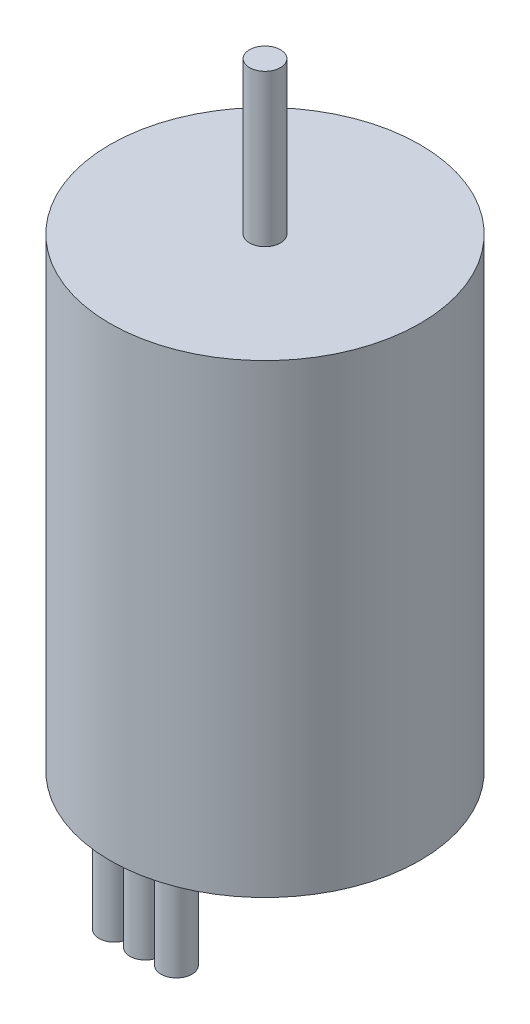
ISO-10303-21;
HEADER;
FILE_DESCRIPTION(('STEP AP214'),'2;1');
FILE_NAME('part.step','',(''),(''),'','','');
FILE_SCHEMA(('AUTOMOTIVE_DESIGN { 1 0 10303 214 1 1 1 1 }'));
ENDSEC;
DATA;
#1=APPLICATION_CONTEXT('core data for automotive mechanical design processes');
#2=APPLICATION_PROTOCOL_DEFINITION('international standard','automotive_design',2000,#1);
#3=PRODUCT_CONTEXT('',#1,'mechanical');
#4=PRODUCT('Part','Part','',(#3));
#5=PRODUCT_RELATED_PRODUCT_CATEGORY('part','',(#4));
#6=PRODUCT_DEFINITION_FORMATION('','',#4);
#7=PRODUCT_DEFINITION_CONTEXT('part definition',#1,'design');
#8=PRODUCT_DEFINITION('design','',#6,#7);
#9=PRODUCT_DEFINITION_SHAPE('','',#8);
#10=(LENGTH_UNIT() NAMED_UNIT(*) SI_UNIT(.MILLI.,.METRE.));
#11=(NAMED_UNIT(*) PLANE_ANGLE_UNIT() SI_UNIT($,.RADIAN.));
#12=(NAMED_UNIT(*) SI_UNIT($,.STERADIAN.) SOLID_ANGLE_UNIT());
#13=UNCERTAINTY_MEASURE_WITH_UNIT(LENGTH_MEASURE(1.E-05),#10,'distance_accuracy_value','');
#14=(GEOMETRIC_REPRESENTATION_CONTEXT(3) GLOBAL_UNCERTAINTY_ASSIGNED_CONTEXT((#13)) GLOBAL_UNIT_ASSIGNED_CONTEXT((#10,
#11,#12)) REPRESENTATION_CONTEXT('',''));
#15=CARTESIAN_POINT('',(0.,0.,0.));
#16=DIRECTION('',(0.,0.,1.));
#17=DIRECTION('',(1.,0.,0.));
#18=AXIS2_PLACEMENT_3D('',#15,#16,#17);
#19=CARTESIAN_POINT('',(-2.,-6.,10.3375938450349));
#20=DIRECTION('',(0.,-1.,0.));
#21=DIRECTION('',(0.,0.,-1.));
#22=AXIS2_PLACEMENT_3D('',#19,#20,#21);
#23=PLANE('',#22);
#24=CARTESIAN_POINT('',(-2.,-6.,10.3375938450349));
#25=DIRECTION('',(0.,-1.,0.));
#26=DIRECTION('',(1.,0.,0.));
#27=AXIS2_PLACEMENT_3D('',#24,#25,#26);
#28=CIRCLE('',#27,1.);
#29=CARTESIAN_POINT('',(-1.,-6.,10.3375938450349));
#30=VERTEX_POINT('',#29);
#31=CARTESIAN_POINT('',(-3.,-6.,10.3375938450349));
#32=VERTEX_POINT('',#31);
#33=EDGE_CURVE('E38',#30,#32,#28,.T.);
#34=ORIENTED_EDGE('',*,*,#33,.T.);
#35=CARTESIAN_POINT('',(-2.,-6.,10.3375938450349));
#36=DIRECTION('',(0.,-1.,0.));
#37=DIRECTION('',(1.,0.,0.));
#38=AXIS2_PLACEMENT_3D('',#35,#36,#37);
#39=CIRCLE('',#38,1.);
#40=EDGE_CURVE('E10',#32,#30,#39,.T.);
#41=ORIENTED_EDGE('',*,*,#40,.T.);
#42=EDGE_LOOP('',(#34,#41));
#43=FACE_BOUND('',#42,.T.);
#44=ADVANCED_FACE('F16',(#43),#23,.T.);
#45=CARTESIAN_POINT('',(-2.,0.,10.3375938450349));
#46=DIRECTION('',(0.,-1.,0.));
#47=DIRECTION('',(1.,0.,0.));
#48=AXIS2_PLACEMENT_3D('',#45,#46,#47);
#49=CYLINDRICAL_SURFACE('',#48,1.);
#50=DIRECTION('',(0.,1.,0.));
#51=VECTOR('',#50,1.);
#52=CARTESIAN_POINT('',(-3.,0.,10.3375938450349));
#53=LINE('',#52,#51);
#54=CARTESIAN_POINT('',(-3.,0.,10.3375938450349));
#55=VERTEX_POINT('',#54);
#56=EDGE_CURVE('E110',#32,#55,#53,.T.);
#57=ORIENTED_EDGE('',*,*,#56,.T.);
#58=CARTESIAN_POINT('',(-2.,0.,10.3375938450349));
#59=DIRECTION('',(0.,-1.,0.));
#60=DIRECTION('',(1.,0.,0.));
#61=AXIS2_PLACEMENT_3D('',#58,#59,#60);
#62=CIRCLE('',#61,1.);
#63=CARTESIAN_POINT('',(-1.,0.,10.3375938450349));
#64=VERTEX_POINT('',#63);
#65=EDGE_CURVE('E118',#55,#64,#62,.T.);
#66=ORIENTED_EDGE('',*,*,#65,.T.);
#67=DIRECTION('',(0.,-1.,0.));
#68=VECTOR('',#67,1.);
#69=CARTESIAN_POINT('',(-1.,0.,10.3375938450349));
#70=LINE('',#69,#68);
#71=EDGE_CURVE('E147',#64,#30,#70,.T.);
#72=ORIENTED_EDGE('',*,*,#71,.T.);
#73=ORIENTED_EDGE('',*,*,#40,.F.);
#74=EDGE_LOOP('',(#57,#66,#72,#73));
#75=FACE_BOUND('',#74,.T.);
#76=ADVANCED_FACE('F175',(#75),#49,.T.);
#77=CARTESIAN_POINT('',(0.,-6.,10.3375938450349));
#78=DIRECTION('',(0.,-1.,0.));
#79=DIRECTION('',(0.,0.,-1.));
#80=AXIS2_PLACEMENT_3D('',#77,#78,#79);
#81=PLANE('',#80);
#82=CARTESIAN_POINT('',(0.,-6.,10.3375938450349));
#83=DIRECTION('',(0.,-1.,0.));
#84=DIRECTION('',(1.,0.,0.));
#85=AXIS2_PLACEMENT_3D('',#82,#83,#84);
#86=CIRCLE('',#85,1.);
#87=CARTESIAN_POINT('',(-1.,-6.,10.3375938450349));
#88=VERTEX_POINT('',#87);
#89=CARTESIAN_POINT('',(1.,-6.,10.3375938450349));
#90=VERTEX_POINT('',#89);
#91=EDGE_CURVE('E20',#88,#90,#86,.T.);
#92=ORIENTED_EDGE('',*,*,#91,.T.);
#93=CARTESIAN_POINT('',(0.,-6.,10.3375938450349));
#94=DIRECTION('',(0.,-1.,0.));
#95=DIRECTION('',(1.,0.,0.));
#96=AXIS2_PLACEMENT_3D('',#93,#94,#95);
#97=CIRCLE('',#96,1.);
#98=EDGE_CURVE('E142',#90,#88,#97,.T.);
#99=ORIENTED_EDGE('',*,*,#98,.T.);
#100=EDGE_LOOP('',(#92,#99));
#101=FACE_BOUND('',#100,.T.);
#102=ADVANCED_FACE('F164',(#101),#81,.T.);
#103=CARTESIAN_POINT('',(0.,0.,10.3375938450349));
#104=DIRECTION('',(0.,-1.,0.));
#105=DIRECTION('',(1.,0.,0.));
#106=AXIS2_PLACEMENT_3D('',#103,#104,#105);
#107=CYLINDRICAL_SURFACE('',#106,1.);
#108=DIRECTION('',(0.,-1.,0.));
#109=VECTOR('',#108,1.);
#110=CARTESIAN_POINT('',(1.,0.,10.3375938450349));
#111=LINE('',#110,#109);
#112=CARTESIAN_POINT('',(1.,0.,10.3375938450349));
#113=VERTEX_POINT('',#112);
#114=EDGE_CURVE('E48',#113,#90,#111,.T.);
#115=ORIENTED_EDGE('',*,*,#114,.T.);
#116=ORIENTED_EDGE('',*,*,#91,.F.);
#117=DIRECTION('',(0.,-1.,0.));
#118=VECTOR('',#117,1.);
#119=CARTESIAN_POINT('',(-1.,0.,10.3375938450349));
#120=LINE('',#119,#118);
#121=EDGE_CURVE('E136',#64,#88,#120,.T.);
#122=ORIENTED_EDGE('',*,*,#121,.F.);
#123=CARTESIAN_POINT('',(0.,0.,10.3375938450349));
#124=DIRECTION('',(0.,-1.,0.));
#125=DIRECTION('',(1.,0.,0.));
#126=AXIS2_PLACEMENT_3D('',#123,#124,#125);
#127=CIRCLE('',#126,1.);
#128=EDGE_CURVE('E125',#64,#113,#127,.T.);
#129=ORIENTED_EDGE('',*,*,#128,.T.);
#130=EDGE_LOOP('',(#115,#116,#122,#129));
#131=FACE_BOUND('',#130,.T.);
#132=ADVANCED_FACE('F165',(#131),#107,.T.);
#133=CARTESIAN_POINT('',(0.,0.,10.3375938450349));
#134=DIRECTION('',(0.,-1.,0.));
#135=DIRECTION('',(1.,0.,0.));
#136=AXIS2_PLACEMENT_3D('',#133,#134,#135);
#137=CYLINDRICAL_SURFACE('',#136,1.);
#138=ORIENTED_EDGE('',*,*,#114,.F.);
#139=CARTESIAN_POINT('',(0.,0.,10.3375938450349));
#140=DIRECTION('',(0.,-1.,0.));
#141=DIRECTION('',(1.,0.,0.));
#142=AXIS2_PLACEMENT_3D('',#139,#140,#141);
#143=CIRCLE('',#142,1.);
#144=EDGE_CURVE('E113',#113,#64,#143,.T.);
#145=ORIENTED_EDGE('',*,*,#144,.T.);
#146=ORIENTED_EDGE('',*,*,#121,.T.);
#147=ORIENTED_EDGE('',*,*,#98,.F.);
#148=EDGE_LOOP('',(#138,#145,#146,#147));
#149=FACE_BOUND('',#148,.T.);
#150=ADVANCED_FACE('F169',(#149),#137,.T.);
#151=CARTESIAN_POINT('',(2.,-6.,10.3375938450349));
#152=DIRECTION('',(0.,-1.,0.));
#153=DIRECTION('',(0.,0.,-1.));
#154=AXIS2_PLACEMENT_3D('',#151,#152,#153);
#155=PLANE('',#154);
#156=CARTESIAN_POINT('',(2.,-6.,10.3375938450349));
#157=DIRECTION('',(0.,-1.,0.));
#158=DIRECTION('',(1.,0.,0.));
#159=AXIS2_PLACEMENT_3D('',#156,#157,#158);
#160=CIRCLE('',#159,1.);
#161=CARTESIAN_POINT('',(1.,-6.,10.3375938450349));
#162=VERTEX_POINT('',#161);
#163=EDGE_CURVE('E103',#162,#162,#160,.T.);
#164=ORIENTED_EDGE('',*,*,#163,.T.);
#165=EDGE_LOOP('',(#164));
#166=FACE_BOUND('',#165,.T.);
#167=ADVANCED_FACE('F205',(#166),#155,.T.);
#168=CARTESIAN_POINT('',(2.,0.,10.3375938450349));
#169=DIRECTION('',(0.,-1.,0.));
#170=DIRECTION('',(1.,0.,0.));
#171=AXIS2_PLACEMENT_3D('',#168,#169,#170);
#172=CYLINDRICAL_SURFACE('',#171,1.);
#173=CARTESIAN_POINT('',(2.,0.,10.3375938450349));
#174=DIRECTION('',(0.,-1.,0.));
#175=DIRECTION('',(1.,0.,0.));
#176=AXIS2_PLACEMENT_3D('',#173,#174,#175);
#177=CIRCLE('',#176,1.);
#178=EDGE_CURVE('E121',#113,#113,#177,.T.);
#179=ORIENTED_EDGE('',*,*,#178,.T.);
#180=DIRECTION('',(0.,-1.,0.));
#181=VECTOR('',#180,1.);
#182=CARTESIAN_POINT('',(1.,0.,10.3375938450349));
#183=LINE('',#182,#181);
#184=EDGE_CURVE('E97',#113,#162,#183,.T.);
#185=ORIENTED_EDGE('',*,*,#184,.T.);
#186=ORIENTED_EDGE('',*,*,#163,.F.);
#187=ORIENTED_EDGE('',*,*,#184,.F.);
#188=EDGE_LOOP('',(#179,#185,#186,#187));
#189=FACE_BOUND('',#188,.T.);
#190=ADVANCED_FACE('F202',(#189),#172,.T.);
#191=CARTESIAN_POINT('',(0.,30.,2.62406438216944));
#192=DIRECTION('',(0.,1.,0.));
#193=DIRECTION('',(1.,0.,0.));
#194=AXIS2_PLACEMENT_3D('',#191,#192,#193);
#195=PLANE('',#194);
#196=CARTESIAN_POINT('',(0.,30.,2.62406438216944));
#197=DIRECTION('',(0.,-1.,0.));
#198=DIRECTION('',(-1.,0.,0.));
#199=AXIS2_PLACEMENT_3D('',#196,#197,#198);
#200=CIRCLE('',#199,1.);
#201=CARTESIAN_POINT('',(1.,30.,2.62406438216944));
#202=VERTEX_POINT('',#201);
#203=EDGE_CURVE('E106',#202,#202,#200,.T.);
#204=ORIENTED_EDGE('',*,*,#203,.T.);
#205=EDGE_LOOP('',(#204));
#206=FACE_BOUND('',#205,.T.);
#207=CARTESIAN_POINT('',(0.,30.,2.62406438216944));
#208=DIRECTION('',(0.,1.,0.));
#209=DIRECTION('',(1.,0.,0.));
#210=AXIS2_PLACEMENT_3D('',#207,#208,#209);
#211=CIRCLE('',#210,10.);
#212=CARTESIAN_POINT('',(-10.,30.,2.62406438216944));
#213=VERTEX_POINT('',#212);
#214=EDGE_CURVE('E95',#213,#213,#211,.T.);
#215=ORIENTED_EDGE('',*,*,#214,.T.);
#216=EDGE_LOOP('',(#215));
#217=FACE_BOUND('',#216,.T.);
#218=ADVANCED_FACE('F197',(#206,#217),#195,.T.);
#219=CARTESIAN_POINT('',(0.,0.,2.62406438216944));
#220=DIRECTION('',(0.,1.,0.));
#221=DIRECTION('',(1.,0.,0.));
#222=AXIS2_PLACEMENT_3D('',#219,#220,#221);
#223=CYLINDRICAL_SURFACE('',#222,10.);
#224=ORIENTED_EDGE('',*,*,#214,.F.);
#225=DIRECTION('',(0.,-1.,0.));
#226=VECTOR('',#225,1.);
#227=CARTESIAN_POINT('',(-10.,0.,2.62406438216944));
#228=LINE('',#227,#226);
#229=CARTESIAN_POINT('',(-10.,0.,2.62406438216944));
#230=VERTEX_POINT('',#229);
#231=EDGE_CURVE('E91',#213,#230,#228,.T.);
#232=ORIENTED_EDGE('',*,*,#231,.T.);
#233=CARTESIAN_POINT('',(0.,0.,2.62406438216944));
#234=DIRECTION('',(0.,1.,0.));
#235=DIRECTION('',(1.,0.,0.));
#236=AXIS2_PLACEMENT_3D('',#233,#234,#235);
#237=CIRCLE('',#236,10.);
#238=EDGE_CURVE('E93',#230,#230,#237,.T.);
#239=ORIENTED_EDGE('',*,*,#238,.T.);
#240=ORIENTED_EDGE('',*,*,#231,.F.);
#241=EDGE_LOOP('',(#224,#232,#239,#240));
#242=FACE_BOUND('',#241,.T.);
#243=ADVANCED_FACE('F18',(#242),#223,.T.);
#244=CARTESIAN_POINT('',(0.,39.8,2.62406438216944));
#245=DIRECTION('',(0.,1.,0.));
#246=DIRECTION('',(1.,0.,0.));
#247=AXIS2_PLACEMENT_3D('',#244,#245,#246);
#248=PLANE('',#247);
#249=CARTESIAN_POINT('',(0.,39.8,2.62406438216944));
#250=DIRECTION('',(0.,1.,0.));
#251=DIRECTION('',(-1.,0.,0.));
#252=AXIS2_PLACEMENT_3D('',#249,#250,#251);
#253=CIRCLE('',#252,1.);
#254=CARTESIAN_POINT('',(1.,39.8,2.62406438216944));
#255=VERTEX_POINT('',#254);
#256=EDGE_CURVE('E117',#255,#255,#253,.T.);
#257=ORIENTED_EDGE('',*,*,#256,.T.);
#258=EDGE_LOOP('',(#257));
#259=FACE_BOUND('',#258,.T.);
#260=ADVANCED_FACE('F198',(#259),#248,.T.);
#261=CARTESIAN_POINT('',(0.,30.,2.62406438216944));
#262=DIRECTION('',(0.,1.,0.));
#263=DIRECTION('',(-1.,0.,0.));
#264=AXIS2_PLACEMENT_3D('',#261,#262,#263);
#265=CYLINDRICAL_SURFACE('',#264,1.);
#266=ORIENTED_EDGE('',*,*,#256,.F.);
#267=DIRECTION('',(0.,-1.,0.));
#268=VECTOR('',#267,1.);
#269=CARTESIAN_POINT('',(1.,30.,2.62406438216944));
#270=LINE('',#269,#268);
#271=EDGE_CURVE('E129',#255,#202,#270,.T.);
#272=ORIENTED_EDGE('',*,*,#271,.T.);
#273=ORIENTED_EDGE('',*,*,#203,.F.);
#274=ORIENTED_EDGE('',*,*,#271,.F.);
#275=EDGE_LOOP('',(#266,#272,#273,#274));
#276=FACE_BOUND('',#275,.T.);
#277=ADVANCED_FACE('F185',(#276),#265,.T.);
#278=CARTESIAN_POINT('',(0.,0.,2.62406438216944));
#279=DIRECTION('',(0.,1.,0.));
#280=DIRECTION('',(1.,0.,0.));
#281=AXIS2_PLACEMENT_3D('',#278,#279,#280);
#282=PLANE('',#281);
#283=ORIENTED_EDGE('',*,*,#178,.F.);
#284=ORIENTED_EDGE('',*,*,#128,.F.);
#285=ORIENTED_EDGE('',*,*,#65,.F.);
#286=CARTESIAN_POINT('',(-2.,0.,10.3375938450349));
#287=DIRECTION('',(0.,-1.,0.));
#288=DIRECTION('',(1.,0.,0.));
#289=AXIS2_PLACEMENT_3D('',#286,#287,#288);
#290=CIRCLE('',#289,1.);
#291=EDGE_CURVE('E122',#64,#55,#290,.T.);
#292=ORIENTED_EDGE('',*,*,#291,.F.);
#293=ORIENTED_EDGE('',*,*,#144,.F.);
#294=EDGE_LOOP('',(#283,#284,#285,#292,#293));
#295=FACE_BOUND('',#294,.T.);
#296=ORIENTED_EDGE('',*,*,#238,.F.);
#297=EDGE_LOOP('',(#296));
#298=FACE_BOUND('',#297,.T.);
#299=ADVANCED_FACE('F176',(#295,#298),#282,.F.);
#300=CARTESIAN_POINT('',(-2.,0.,10.3375938450349));
#301=DIRECTION('',(0.,-1.,0.));
#302=DIRECTION('',(1.,0.,0.));
#303=AXIS2_PLACEMENT_3D('',#300,#301,#302);
#304=CYLINDRICAL_SURFACE('',#303,1.);
#305=ORIENTED_EDGE('',*,*,#56,.F.);
#306=ORIENTED_EDGE('',*,*,#33,.F.);
#307=ORIENTED_EDGE('',*,*,#71,.F.);
#308=ORIENTED_EDGE('',*,*,#291,.T.);
#309=EDGE_LOOP('',(#305,#306,#307,#308));
#310=FACE_BOUND('',#309,.T.);
#311=ADVANCED_FACE('F178',(#310),#304,.T.);
#312=CLOSED_SHELL('',(#44,#76,#102,#132,#150,#167,#190,#218,#243,#260,#277,#299,#311));
#313=MANIFOLD_SOLID_BREP('B1',#312);
#314=ADVANCED_BREP_SHAPE_REPRESENTATION('',(#18,#313),#14);
#315=SHAPE_DEFINITION_REPRESENTATION(#9,#314);
ENDSEC;
END-ISO-10303-21;
